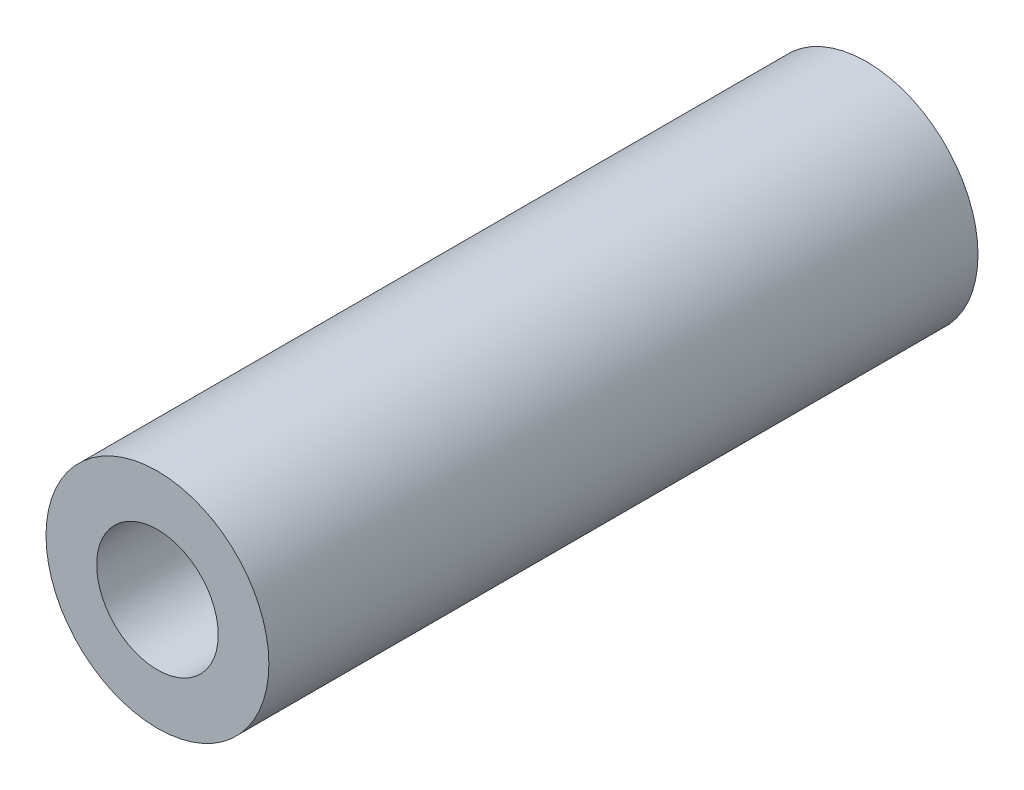
ISO-10303-21;
HEADER;
FILE_DESCRIPTION(('STEP AP214'),'2;1');
FILE_NAME('part.step','',(''),(''),'','','');
FILE_SCHEMA(('AUTOMOTIVE_DESIGN { 1 0 10303 214 1 1 1 1 }'));
ENDSEC;
DATA;
#1=APPLICATION_CONTEXT('core data for automotive mechanical design processes');
#2=APPLICATION_PROTOCOL_DEFINITION('international standard','automotive_design',2000,#1);
#3=PRODUCT_CONTEXT('',#1,'mechanical');
#4=PRODUCT('Part','Part','',(#3));
#5=PRODUCT_RELATED_PRODUCT_CATEGORY('part','',(#4));
#6=PRODUCT_DEFINITION_FORMATION('','',#4);
#7=PRODUCT_DEFINITION_CONTEXT('part definition',#1,'design');
#8=PRODUCT_DEFINITION('design','',#6,#7);
#9=PRODUCT_DEFINITION_SHAPE('','',#8);
#10=(LENGTH_UNIT() NAMED_UNIT(*) SI_UNIT(.MILLI.,.METRE.));
#11=(NAMED_UNIT(*) PLANE_ANGLE_UNIT() SI_UNIT($,.RADIAN.));
#12=(NAMED_UNIT(*) SI_UNIT($,.STERADIAN.) SOLID_ANGLE_UNIT());
#13=UNCERTAINTY_MEASURE_WITH_UNIT(LENGTH_MEASURE(1.E-05),#10,'distance_accuracy_value','');
#14=(GEOMETRIC_REPRESENTATION_CONTEXT(3) GLOBAL_UNCERTAINTY_ASSIGNED_CONTEXT((#13)) GLOBAL_UNIT_ASSIGNED_CONTEXT((#10,
#11,#12)) REPRESENTATION_CONTEXT('',''));
#15=CARTESIAN_POINT('',(0.,0.,0.));
#16=DIRECTION('',(0.,0.,1.));
#17=DIRECTION('',(1.,0.,0.));
#18=AXIS2_PLACEMENT_3D('',#15,#16,#17);
#19=CARTESIAN_POINT('',(0.,0.,17.5));
#20=DIRECTION('',(0.,0.,1.));
#21=DIRECTION('',(1.,0.,0.));
#22=AXIS2_PLACEMENT_3D('',#19,#20,#21);
#23=PLANE('',#22);
#24=CARTESIAN_POINT('',(0.,0.,17.5));
#25=DIRECTION('',(0.,0.,1.));
#26=DIRECTION('',(1.,0.,0.));
#27=AXIS2_PLACEMENT_3D('',#24,#25,#26);
#28=CIRCLE('',#27,2.75);
#29=CARTESIAN_POINT('',(2.75,0.,17.5));
#30=VERTEX_POINT('',#29);
#31=EDGE_CURVE('E11',#30,#30,#28,.T.);
#32=ORIENTED_EDGE('',*,*,#31,.T.);
#33=EDGE_LOOP('',(#32));
#34=FACE_BOUND('',#33,.T.);
#35=CARTESIAN_POINT('',(0.,0.,17.5));
#36=DIRECTION('',(0.,0.,1.));
#37=DIRECTION('',(1.,0.,0.));
#38=AXIS2_PLACEMENT_3D('',#35,#36,#37);
#39=CIRCLE('',#38,1.5);
#40=CARTESIAN_POINT('',(1.5,0.,17.5));
#41=VERTEX_POINT('',#40);
#42=EDGE_CURVE('E62',#41,#41,#39,.T.);
#43=ORIENTED_EDGE('',*,*,#42,.F.);
#44=EDGE_LOOP('',(#43));
#45=FACE_BOUND('',#44,.T.);
#46=ADVANCED_FACE('F49',(#34,#45),#23,.T.);
#47=CARTESIAN_POINT('',(0.,0.,0.));
#48=DIRECTION('',(0.,0.,1.));
#49=DIRECTION('',(1.,0.,0.));
#50=AXIS2_PLACEMENT_3D('',#47,#48,#49);
#51=PLANE('',#50);
#52=CARTESIAN_POINT('',(0.,0.,0.));
#53=DIRECTION('',(0.,0.,1.));
#54=DIRECTION('',(1.,0.,0.));
#55=AXIS2_PLACEMENT_3D('',#52,#53,#54);
#56=CIRCLE('',#55,2.75);
#57=CARTESIAN_POINT('',(2.75,0.,0.));
#58=VERTEX_POINT('',#57);
#59=EDGE_CURVE('E53',#58,#58,#56,.T.);
#60=ORIENTED_EDGE('',*,*,#59,.F.);
#61=EDGE_LOOP('',(#60));
#62=FACE_BOUND('',#61,.T.);
#63=CARTESIAN_POINT('',(0.,0.,0.));
#64=DIRECTION('',(0.,0.,1.));
#65=DIRECTION('',(1.,0.,0.));
#66=AXIS2_PLACEMENT_3D('',#63,#64,#65);
#67=CIRCLE('',#66,1.5);
#68=CARTESIAN_POINT('',(1.5,0.,0.));
#69=VERTEX_POINT('',#68);
#70=EDGE_CURVE('E64',#69,#69,#67,.T.);
#71=ORIENTED_EDGE('',*,*,#70,.T.);
#72=EDGE_LOOP('',(#71));
#73=FACE_BOUND('',#72,.T.);
#74=ADVANCED_FACE('F76',(#62,#73),#51,.F.);
#75=CARTESIAN_POINT('',(0.,0.,17.5));
#76=DIRECTION('',(0.,0.,-1.));
#77=DIRECTION('',(-1.,0.,0.));
#78=AXIS2_PLACEMENT_3D('',#75,#76,#77);
#79=CYLINDRICAL_SURFACE('',#78,2.75);
#80=ORIENTED_EDGE('',*,*,#31,.F.);
#81=EDGE_LOOP('',(#80));
#82=FACE_BOUND('',#81,.T.);
#83=ORIENTED_EDGE('',*,*,#59,.T.);
#84=EDGE_LOOP('',(#83));
#85=FACE_BOUND('',#84,.T.);
#86=ADVANCED_FACE('F51',(#82,#85),#79,.T.);
#87=CARTESIAN_POINT('',(0.,0.,17.5));
#88=DIRECTION('',(0.,0.,-1.));
#89=DIRECTION('',(-1.,0.,0.));
#90=AXIS2_PLACEMENT_3D('',#87,#88,#89);
#91=CYLINDRICAL_SURFACE('',#90,1.5);
#92=ORIENTED_EDGE('',*,*,#42,.T.);
#93=EDGE_LOOP('',(#92));
#94=FACE_BOUND('',#93,.T.);
#95=ORIENTED_EDGE('',*,*,#70,.F.);
#96=EDGE_LOOP('',(#95));
#97=FACE_BOUND('',#96,.T.);
#98=ADVANCED_FACE('F72',(#94,#97),#91,.F.);
#99=CLOSED_SHELL('',(#46,#74,#86,#98));
#100=MANIFOLD_SOLID_BREP('B2',#99);
#101=ADVANCED_BREP_SHAPE_REPRESENTATION('',(#18,#100),#14);
#102=SHAPE_DEFINITION_REPRESENTATION(#9,#101);
ENDSEC;
END-ISO-10303-21;
